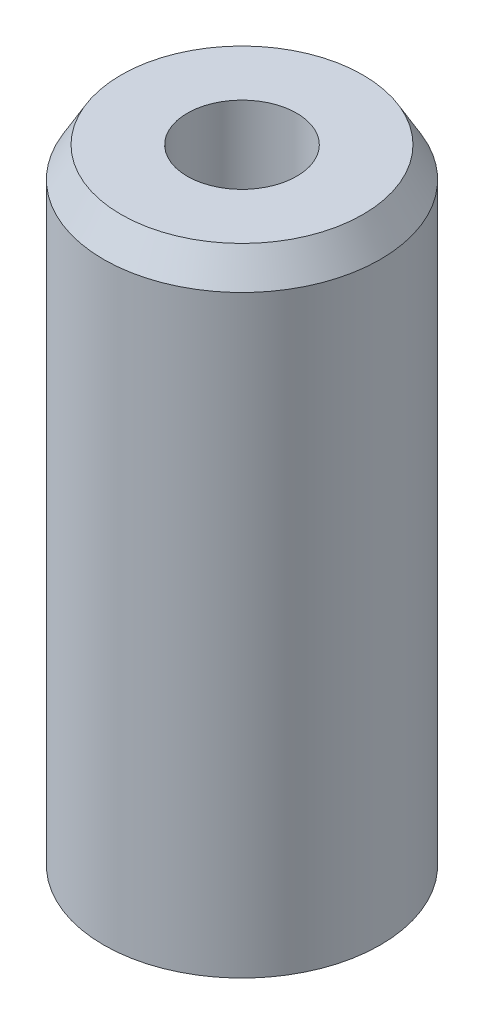
ISO-10303-21;
HEADER;
FILE_DESCRIPTION(('STEP AP214'),'2;1');
FILE_NAME('part.step','',(''),(''),'','','');
FILE_SCHEMA(('AUTOMOTIVE_DESIGN { 1 0 10303 214 1 1 1 1 }'));
ENDSEC;
DATA;
#1=APPLICATION_CONTEXT('core data for automotive mechanical design processes');
#2=APPLICATION_PROTOCOL_DEFINITION('international standard','automotive_design',2000,#1);
#3=PRODUCT_CONTEXT('',#1,'mechanical');
#4=PRODUCT('Part','Part','',(#3));
#5=PRODUCT_RELATED_PRODUCT_CATEGORY('part','',(#4));
#6=PRODUCT_DEFINITION_FORMATION('','',#4);
#7=PRODUCT_DEFINITION_CONTEXT('part definition',#1,'design');
#8=PRODUCT_DEFINITION('design','',#6,#7);
#9=PRODUCT_DEFINITION_SHAPE('','',#8);
#10=(LENGTH_UNIT() NAMED_UNIT(*) SI_UNIT(.MILLI.,.METRE.));
#11=(NAMED_UNIT(*) PLANE_ANGLE_UNIT() SI_UNIT($,.RADIAN.));
#12=(NAMED_UNIT(*) SI_UNIT($,.STERADIAN.) SOLID_ANGLE_UNIT());
#13=UNCERTAINTY_MEASURE_WITH_UNIT(LENGTH_MEASURE(1.E-05),#10,'distance_accuracy_value','');
#14=(GEOMETRIC_REPRESENTATION_CONTEXT(3) GLOBAL_UNCERTAINTY_ASSIGNED_CONTEXT((#13)) GLOBAL_UNIT_ASSIGNED_CONTEXT((#10,
#11,#12)) REPRESENTATION_CONTEXT('',''));
#15=CARTESIAN_POINT('',(0.,0.,0.));
#16=DIRECTION('',(0.,0.,1.));
#17=DIRECTION('',(1.,0.,0.));
#18=AXIS2_PLACEMENT_3D('',#15,#16,#17);
#19=CARTESIAN_POINT('',(0.,23.179603195105,0.));
#20=DIRECTION('',(0.,-1.,0.));
#21=DIRECTION('',(0.,0.,-1.));
#22=AXIS2_PLACEMENT_3D('',#19,#20,#21);
#23=CYLINDRICAL_SURFACE('',#22,5.);
#24=CARTESIAN_POINT('',(0.,22.0889587599688,0.));
#25=DIRECTION('',(0.,1.,0.));
#26=DIRECTION('',(0.,0.,1.));
#27=AXIS2_PLACEMENT_3D('',#24,#25,#26);
#28=CIRCLE('',#27,5.);
#29=CARTESIAN_POINT('',(0.,22.0889587599688,5.));
#30=VERTEX_POINT('',#29);
#31=EDGE_CURVE('E50',#30,#30,#28,.F.);
#32=ORIENTED_EDGE('',*,*,#31,.T.);
#33=EDGE_LOOP('',(#32));
#34=FACE_BOUND('',#33,.T.);
#35=CARTESIAN_POINT('',(0.,0.629683858216074,0.));
#36=DIRECTION('',(0.,1.,0.));
#37=DIRECTION('',(0.,0.,1.));
#38=AXIS2_PLACEMENT_3D('',#35,#36,#37);
#39=CIRCLE('',#38,5.);
#40=CARTESIAN_POINT('',(0.,0.629683858216074,5.));
#41=VERTEX_POINT('',#40);
#42=EDGE_CURVE('E51',#41,#41,#39,.T.);
#43=ORIENTED_EDGE('',*,*,#42,.T.);
#44=EDGE_LOOP('',(#43));
#45=FACE_BOUND('',#44,.T.);
#46=ADVANCED_FACE('F39',(#34,#45),#23,.T.);
#47=CARTESIAN_POINT('',(0.,23.179603195105,0.));
#48=DIRECTION('',(0.,1.,0.));
#49=DIRECTION('',(0.,0.,1.));
#50=AXIS2_PLACEMENT_3D('',#47,#48,#49);
#51=PLANE('',#50);
#52=CARTESIAN_POINT('',(0.,23.179603195105,0.));
#53=DIRECTION('',(0.,1.,0.));
#54=DIRECTION('',(0.,0.,1.));
#55=AXIS2_PLACEMENT_3D('',#52,#53,#54);
#56=CIRCLE('',#55,4.37031614178393);
#57=CARTESIAN_POINT('',(0.,23.179603195105,4.37031614178393));
#58=VERTEX_POINT('',#57);
#59=EDGE_CURVE('E54',#58,#58,#56,.T.);
#60=ORIENTED_EDGE('',*,*,#59,.T.);
#61=EDGE_LOOP('',(#60));
#62=FACE_BOUND('',#61,.T.);
#63=CARTESIAN_POINT('',(0.,23.179603195105,0.));
#64=DIRECTION('',(0.,1.,0.));
#65=DIRECTION('',(0.,0.,1.));
#66=AXIS2_PLACEMENT_3D('',#63,#64,#65);
#67=CIRCLE('',#66,1.97710477132033);
#68=CARTESIAN_POINT('',(0.,23.179603195105,1.97710477132033));
#69=VERTEX_POINT('',#68);
#70=EDGE_CURVE('E58',#69,#69,#67,.T.);
#71=ORIENTED_EDGE('',*,*,#70,.F.);
#72=EDGE_LOOP('',(#71));
#73=FACE_BOUND('',#72,.T.);
#74=ADVANCED_FACE('F69',(#62,#73),#51,.T.);
#75=CARTESIAN_POINT('',(0.,0.,0.));
#76=DIRECTION('',(0.,1.,0.));
#77=DIRECTION('',(0.,0.,1.));
#78=AXIS2_PLACEMENT_3D('',#75,#76,#77);
#79=PLANE('',#78);
#80=CARTESIAN_POINT('',(0.,0.,0.));
#81=DIRECTION('',(0.,1.,0.));
#82=DIRECTION('',(0.,0.,1.));
#83=AXIS2_PLACEMENT_3D('',#80,#81,#82);
#84=CIRCLE('',#83,3.90935556486376);
#85=CARTESIAN_POINT('',(0.,0.,3.90935556486376));
#86=VERTEX_POINT('',#85);
#87=EDGE_CURVE('E10',#86,#86,#84,.F.);
#88=ORIENTED_EDGE('',*,*,#87,.T.);
#89=EDGE_LOOP('',(#88));
#90=FACE_BOUND('',#89,.T.);
#91=CARTESIAN_POINT('',(0.,0.,0.));
#92=DIRECTION('',(0.,1.,0.));
#93=DIRECTION('',(0.,0.,1.));
#94=AXIS2_PLACEMENT_3D('',#91,#92,#93);
#95=CIRCLE('',#94,1.97710477132033);
#96=CARTESIAN_POINT('',(0.,0.,1.97710477132033));
#97=VERTEX_POINT('',#96);
#98=EDGE_CURVE('E63',#97,#97,#95,.T.);
#99=ORIENTED_EDGE('',*,*,#98,.T.);
#100=EDGE_LOOP('',(#99));
#101=FACE_BOUND('',#100,.T.);
#102=ADVANCED_FACE('F75',(#90,#101),#79,.F.);
#103=CARTESIAN_POINT('',(0.,23.179603195105,0.));
#104=DIRECTION('',(0.,-1.,0.));
#105=DIRECTION('',(0.,0.,-1.));
#106=AXIS2_PLACEMENT_3D('',#103,#104,#105);
#107=CYLINDRICAL_SURFACE('',#106,1.97710477132033);
#108=ORIENTED_EDGE('',*,*,#70,.T.);
#109=EDGE_LOOP('',(#108));
#110=FACE_BOUND('',#109,.T.);
#111=ORIENTED_EDGE('',*,*,#98,.F.);
#112=EDGE_LOOP('',(#111));
#113=FACE_BOUND('',#112,.T.);
#114=ADVANCED_FACE('F70',(#110,#113),#107,.F.);
#115=CARTESIAN_POINT('',(0.,23.179603195105,0.));
#116=DIRECTION('',(0.,-1.,0.));
#117=DIRECTION('',(0.,0.,-1.));
#118=AXIS2_PLACEMENT_3D('',#115,#116,#117);
#119=CONICAL_SURFACE('',#118,4.37031614178393,0.523598775598295);
#120=ORIENTED_EDGE('',*,*,#31,.F.);
#121=EDGE_LOOP('',(#120));
#122=FACE_BOUND('',#121,.T.);
#123=ORIENTED_EDGE('',*,*,#59,.F.);
#124=EDGE_LOOP('',(#123));
#125=FACE_BOUND('',#124,.T.);
#126=ADVANCED_FACE('F81',(#122,#125),#119,.T.);
#127=CARTESIAN_POINT('',(0.,0.629683858216074,0.));
#128=DIRECTION('',(0.,1.,0.));
#129=DIRECTION('',(0.,0.,1.));
#130=AXIS2_PLACEMENT_3D('',#127,#128,#129);
#131=CONICAL_SURFACE('',#130,5.,1.0471975511966);
#132=ORIENTED_EDGE('',*,*,#87,.F.);
#133=EDGE_LOOP('',(#132));
#134=FACE_BOUND('',#133,.T.);
#135=ORIENTED_EDGE('',*,*,#42,.F.);
#136=EDGE_LOOP('',(#135));
#137=FACE_BOUND('',#136,.T.);
#138=ADVANCED_FACE('F45',(#134,#137),#131,.T.);
#139=CLOSED_SHELL('',(#46,#74,#102,#114,#126,#138));
#140=MANIFOLD_SOLID_BREP('B2',#139);
#141=ADVANCED_BREP_SHAPE_REPRESENTATION('',(#18,#140),#14);
#142=SHAPE_DEFINITION_REPRESENTATION(#9,#141);
ENDSEC;
END-ISO-10303-21;
